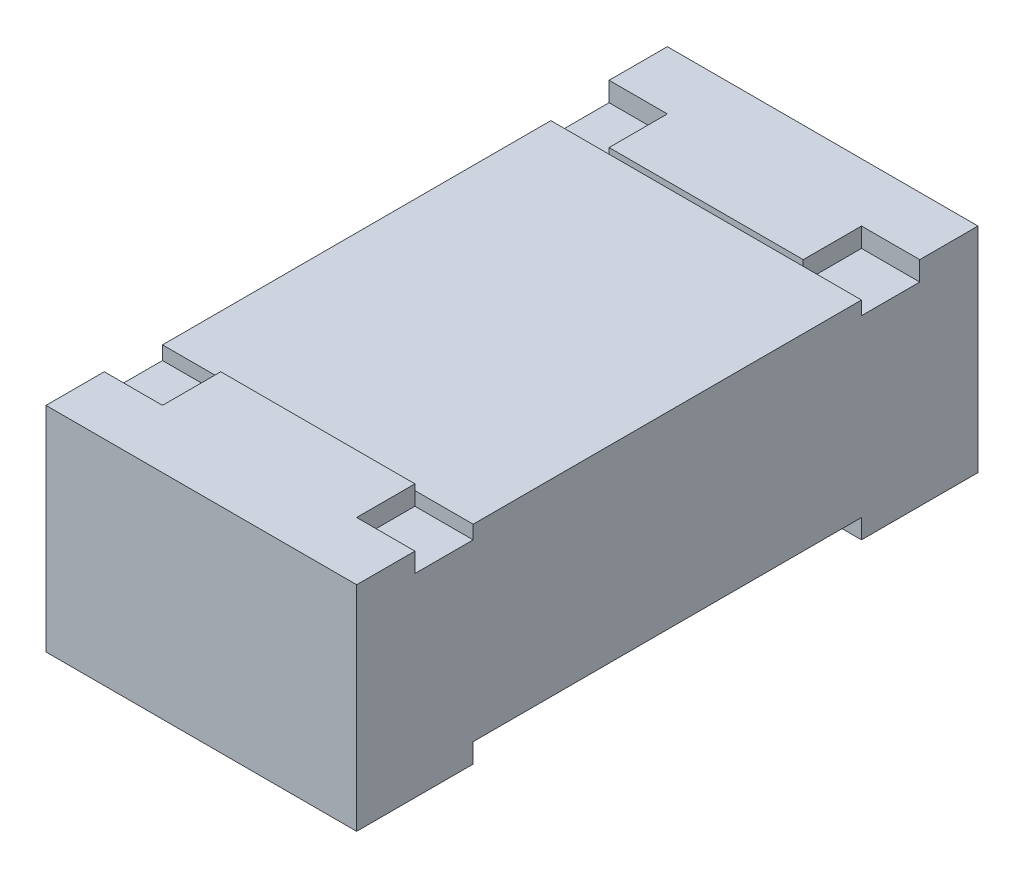
ISO-10303-21;
HEADER;
FILE_DESCRIPTION(('STEP AP214'),'2;1');
FILE_NAME('part.step','',(''),(''),'','','');
FILE_SCHEMA(('AUTOMOTIVE_DESIGN { 1 0 10303 214 1 1 1 1 }'));
ENDSEC;
DATA;
#1=APPLICATION_CONTEXT('core data for automotive mechanical design processes');
#2=APPLICATION_PROTOCOL_DEFINITION('international standard','automotive_design',2000,#1);
#3=PRODUCT_CONTEXT('',#1,'mechanical');
#4=PRODUCT('Part','Part','',(#3));
#5=PRODUCT_RELATED_PRODUCT_CATEGORY('part','',(#4));
#6=PRODUCT_DEFINITION_FORMATION('','',#4);
#7=PRODUCT_DEFINITION_CONTEXT('part definition',#1,'design');
#8=PRODUCT_DEFINITION('design','',#6,#7);
#9=PRODUCT_DEFINITION_SHAPE('','',#8);
#10=(LENGTH_UNIT() NAMED_UNIT(*) SI_UNIT(.MILLI.,.METRE.));
#11=(NAMED_UNIT(*) PLANE_ANGLE_UNIT() SI_UNIT($,.RADIAN.));
#12=(NAMED_UNIT(*) SI_UNIT($,.STERADIAN.) SOLID_ANGLE_UNIT());
#13=UNCERTAINTY_MEASURE_WITH_UNIT(LENGTH_MEASURE(1.E-05),#10,'distance_accuracy_value','');
#14=(GEOMETRIC_REPRESENTATION_CONTEXT(3) GLOBAL_UNCERTAINTY_ASSIGNED_CONTEXT((#13)) GLOBAL_UNIT_ASSIGNED_CONTEXT((#10,
#11,#12)) REPRESENTATION_CONTEXT('',''));
#15=CARTESIAN_POINT('',(0.,0.,0.));
#16=DIRECTION('',(0.,0.,1.));
#17=DIRECTION('',(1.,0.,0.));
#18=AXIS2_PLACEMENT_3D('',#15,#16,#17);
#19=CARTESIAN_POINT('',(-0.234998033030873,1.58166,-17.615));
#20=DIRECTION('',(0.,-1.,0.));
#21=DIRECTION('',(0.,0.,-1.));
#22=AXIS2_PLACEMENT_3D('',#19,#20,#21);
#23=PLANE('',#22);
#24=DIRECTION('',(-1.,0.,0.));
#25=VECTOR('',#24,1.);
#26=CARTESIAN_POINT('',(-0.234998033030869,1.58166,-17.915));
#27=LINE('',#26,#25);
#28=CARTESIAN_POINT('',(-0.234998033030869,1.58166,-17.915));
#29=VERTEX_POINT('',#28);
#30=CARTESIAN_POINT('',(-1.03499803303087,1.58166,-17.915));
#31=VERTEX_POINT('',#30);
#32=EDGE_CURVE('E19',#29,#31,#27,.T.);
#33=ORIENTED_EDGE('',*,*,#32,.F.);
#34=DIRECTION('',(0.,0.,-1.));
#35=VECTOR('',#34,1.);
#36=CARTESIAN_POINT('',(-0.234998033030869,1.58166,-17.915));
#37=LINE('',#36,#35);
#38=CARTESIAN_POINT('',(-0.234998033030871,1.58166,-17.615));
#39=VERTEX_POINT('',#38);
#40=EDGE_CURVE('E295',#39,#29,#37,.T.);
#41=ORIENTED_EDGE('',*,*,#40,.F.);
#42=DIRECTION('',(1.,0.,0.));
#43=VECTOR('',#42,1.);
#44=CARTESIAN_POINT('',(-0.234998033030873,1.58166,-17.615));
#45=LINE('',#44,#43);
#46=CARTESIAN_POINT('',(-1.03499803303087,1.58166,-17.615));
#47=VERTEX_POINT('',#46);
#48=EDGE_CURVE('E305',#47,#39,#45,.T.);
#49=ORIENTED_EDGE('',*,*,#48,.F.);
#50=DIRECTION('',(0.,0.,-1.));
#51=VECTOR('',#50,1.);
#52=CARTESIAN_POINT('',(-1.03499803303087,1.58166,-17.915));
#53=LINE('',#52,#51);
#54=EDGE_CURVE('E231',#47,#31,#53,.T.);
#55=ORIENTED_EDGE('',*,*,#54,.T.);
#56=EDGE_LOOP('',(#33,#41,#49,#55));
#57=FACE_BOUND('',#56,.T.);
#58=ADVANCED_FACE('F16',(#57),#23,.T.);
#59=CARTESIAN_POINT('',(-0.234998033030869,1.58166,-17.915));
#60=DIRECTION('',(0.,0.,-1.));
#61=DIRECTION('',(-1.,0.,0.));
#62=AXIS2_PLACEMENT_3D('',#59,#60,#61);
#63=PLANE('',#62);
#64=DIRECTION('',(1.,0.,0.));
#65=VECTOR('',#64,1.);
#66=CARTESIAN_POINT('',(-0.234998033030864,1.63166,-17.915));
#67=LINE('',#66,#65);
#68=CARTESIAN_POINT('',(-0.234998033030869,1.63166,-17.915));
#69=VERTEX_POINT('',#68);
#70=CARTESIAN_POINT('',(-1.03499803303087,1.63166,-17.915));
#71=VERTEX_POINT('',#70);
#72=EDGE_CURVE('E247',#69,#71,#67,.F.);
#73=ORIENTED_EDGE('',*,*,#72,.F.);
#74=DIRECTION('',(0.,1.,0.));
#75=VECTOR('',#74,1.);
#76=CARTESIAN_POINT('',(-0.234998033030869,1.58166,-17.915));
#77=LINE('',#76,#75);
#78=EDGE_CURVE('E226',#29,#69,#77,.T.);
#79=ORIENTED_EDGE('',*,*,#78,.F.);
#80=ORIENTED_EDGE('',*,*,#32,.T.);
#81=DIRECTION('',(0.,1.,0.));
#82=VECTOR('',#81,1.);
#83=CARTESIAN_POINT('',(-1.03499803303087,1.58166,-17.915));
#84=LINE('',#83,#82);
#85=EDGE_CURVE('E223',#31,#71,#84,.T.);
#86=ORIENTED_EDGE('',*,*,#85,.T.);
#87=EDGE_LOOP('',(#73,#79,#80,#86));
#88=FACE_BOUND('',#87,.T.);
#89=ADVANCED_FACE('F222',(#88),#63,.T.);
#90=CARTESIAN_POINT('',(-0.234998033030864,1.58166,-19.215));
#91=DIRECTION('',(0.,-1.,0.));
#92=DIRECTION('',(0.,0.,-1.));
#93=AXIS2_PLACEMENT_3D('',#90,#91,#92);
#94=PLANE('',#93);
#95=DIRECTION('',(-1.,0.,0.));
#96=VECTOR('',#95,1.);
#97=CARTESIAN_POINT('',(-0.234998033030864,1.58166,-19.215));
#98=LINE('',#97,#96);
#99=CARTESIAN_POINT('',(-0.234998033030865,1.58166,-19.215));
#100=VERTEX_POINT('',#99);
#101=CARTESIAN_POINT('',(-1.03499803303087,1.58166,-19.215));
#102=VERTEX_POINT('',#101);
#103=EDGE_CURVE('E192',#100,#102,#98,.T.);
#104=ORIENTED_EDGE('',*,*,#103,.F.);
#105=DIRECTION('',(0.,0.,1.));
#106=VECTOR('',#105,1.);
#107=CARTESIAN_POINT('',(-0.234998033030869,1.58166,-18.915));
#108=LINE('',#107,#106);
#109=CARTESIAN_POINT('',(-0.234998033030866,1.58166,-18.915));
#110=VERTEX_POINT('',#109);
#111=EDGE_CURVE('E291',#100,#110,#108,.T.);
#112=ORIENTED_EDGE('',*,*,#111,.T.);
#113=DIRECTION('',(1.,0.,0.));
#114=VECTOR('',#113,1.);
#115=CARTESIAN_POINT('',(-0.234998033030869,1.58166,-18.915));
#116=LINE('',#115,#114);
#117=CARTESIAN_POINT('',(-1.03499803303087,1.58166,-18.915));
#118=VERTEX_POINT('',#117);
#119=EDGE_CURVE('E187',#118,#110,#116,.T.);
#120=ORIENTED_EDGE('',*,*,#119,.F.);
#121=DIRECTION('',(0.,0.,1.));
#122=VECTOR('',#121,1.);
#123=CARTESIAN_POINT('',(-1.03499803303087,1.58166,-18.915));
#124=LINE('',#123,#122);
#125=EDGE_CURVE('E203',#102,#118,#124,.T.);
#126=ORIENTED_EDGE('',*,*,#125,.F.);
#127=EDGE_LOOP('',(#104,#112,#120,#126));
#128=FACE_BOUND('',#127,.T.);
#129=ADVANCED_FACE('F204',(#128),#94,.T.);
#130=CARTESIAN_POINT('',(-0.234998033030869,1.58166,-18.915));
#131=DIRECTION('',(0.,0.,1.));
#132=DIRECTION('',(1.,0.,0.));
#133=AXIS2_PLACEMENT_3D('',#130,#131,#132);
#134=PLANE('',#133);
#135=ORIENTED_EDGE('',*,*,#119,.T.);
#136=DIRECTION('',(0.,1.,0.));
#137=VECTOR('',#136,1.);
#138=CARTESIAN_POINT('',(-0.234998033030869,2.08166,-18.915));
#139=LINE('',#138,#137);
#140=CARTESIAN_POINT('',(-0.234998033030868,1.63166,-18.915));
#141=VERTEX_POINT('',#140);
#142=EDGE_CURVE('E289',#110,#141,#139,.T.);
#143=ORIENTED_EDGE('',*,*,#142,.T.);
#144=DIRECTION('',(1.,0.,0.));
#145=VECTOR('',#144,1.);
#146=CARTESIAN_POINT('',(-0.234998033030864,1.63166,-18.915));
#147=LINE('',#146,#145);
#148=CARTESIAN_POINT('',(-1.03499803303087,1.63166,-18.915));
#149=VERTEX_POINT('',#148);
#150=EDGE_CURVE('E245',#149,#141,#147,.T.);
#151=ORIENTED_EDGE('',*,*,#150,.F.);
#152=DIRECTION('',(0.,1.,0.));
#153=VECTOR('',#152,1.);
#154=CARTESIAN_POINT('',(-1.03499803303087,2.08166,-18.915));
#155=LINE('',#154,#153);
#156=EDGE_CURVE('E207',#118,#149,#155,.T.);
#157=ORIENTED_EDGE('',*,*,#156,.F.);
#158=EDGE_LOOP('',(#135,#143,#151,#157));
#159=FACE_BOUND('',#158,.T.);
#160=ADVANCED_FACE('F489',(#159),#134,.T.);
#161=CARTESIAN_POINT('',(-0.234998033030869,2.08166,-19.065));
#162=DIRECTION('',(0.,0.,-1.));
#163=DIRECTION('',(-1.,0.,0.));
#164=AXIS2_PLACEMENT_3D('',#161,#162,#163);
#165=PLANE('',#164);
#166=DIRECTION('',(0.,1.,0.));
#167=VECTOR('',#166,1.);
#168=CARTESIAN_POINT('',(-0.384998033030866,2.08166,-19.065));
#169=LINE('',#168,#167);
#170=CARTESIAN_POINT('',(-0.384998033030866,2.13166,-19.065));
#171=VERTEX_POINT('',#170);
#172=CARTESIAN_POINT('',(-0.384998033030866,2.08166,-19.065));
#173=VERTEX_POINT('',#172);
#174=EDGE_CURVE('E282',#171,#173,#169,.F.);
#175=ORIENTED_EDGE('',*,*,#174,.T.);
#176=DIRECTION('',(1.,0.,0.));
#177=VECTOR('',#176,1.);
#178=CARTESIAN_POINT('',(-0.234998033030864,2.08166,-19.065));
#179=LINE('',#178,#177);
#180=CARTESIAN_POINT('',(-0.234998033030868,2.08166,-19.065));
#181=VERTEX_POINT('',#180);
#182=EDGE_CURVE('E284',#181,#173,#179,.F.);
#183=ORIENTED_EDGE('',*,*,#182,.F.);
#184=DIRECTION('',(0.,1.,0.));
#185=VECTOR('',#184,1.);
#186=CARTESIAN_POINT('',(-0.234998033030868,2.08166,-19.065));
#187=LINE('',#186,#185);
#188=CARTESIAN_POINT('',(-0.234998033030869,2.13166,-19.065));
#189=VERTEX_POINT('',#188);
#190=EDGE_CURVE('E287',#181,#189,#187,.T.);
#191=ORIENTED_EDGE('',*,*,#190,.T.);
#192=DIRECTION('',(1.,0.,0.));
#193=VECTOR('',#192,1.);
#194=CARTESIAN_POINT('',(-0.234998033030869,2.13166,-19.065));
#195=LINE('',#194,#193);
#196=EDGE_CURVE('E274',#171,#189,#195,.T.);
#197=ORIENTED_EDGE('',*,*,#196,.F.);
#198=EDGE_LOOP('',(#175,#183,#191,#197));
#199=FACE_BOUND('',#198,.T.);
#200=ADVANCED_FACE('F491',(#199),#165,.F.);
#201=CARTESIAN_POINT('',(-0.234998033030864,2.13166,-19.215));
#202=DIRECTION('',(0.,0.,-1.));
#203=DIRECTION('',(-1.,0.,0.));
#204=AXIS2_PLACEMENT_3D('',#201,#202,#203);
#205=PLANE('',#204);
#206=DIRECTION('',(1.,0.,0.));
#207=VECTOR('',#206,1.);
#208=CARTESIAN_POINT('',(-0.234998033030869,2.13166,-19.215));
#209=LINE('',#208,#207);
#210=CARTESIAN_POINT('',(-0.234998033030867,2.13166,-19.215));
#211=VERTEX_POINT('',#210);
#212=CARTESIAN_POINT('',(-1.03499803303087,2.13166,-19.215));
#213=VERTEX_POINT('',#212);
#214=EDGE_CURVE('E269',#211,#213,#209,.F.);
#215=ORIENTED_EDGE('',*,*,#214,.F.);
#216=DIRECTION('',(0.,1.,0.));
#217=VECTOR('',#216,1.);
#218=CARTESIAN_POINT('',(-0.234998033030868,2.08166,-19.215));
#219=LINE('',#218,#217);
#220=EDGE_CURVE('E198',#211,#100,#219,.F.);
#221=ORIENTED_EDGE('',*,*,#220,.T.);
#222=ORIENTED_EDGE('',*,*,#103,.T.);
#223=DIRECTION('',(0.,1.,0.));
#224=VECTOR('',#223,1.);
#225=CARTESIAN_POINT('',(-1.03499803303087,2.08166,-19.215));
#226=LINE('',#225,#224);
#227=EDGE_CURVE('E196',#213,#102,#226,.F.);
#228=ORIENTED_EDGE('',*,*,#227,.F.);
#229=EDGE_LOOP('',(#215,#221,#222,#228));
#230=FACE_BOUND('',#229,.T.);
#231=ADVANCED_FACE('F194',(#230),#205,.T.);
#232=CARTESIAN_POINT('',(-1.03499803303087,2.08166,-19.065));
#233=DIRECTION('',(0.,0.,-1.));
#234=DIRECTION('',(-1.,0.,0.));
#235=AXIS2_PLACEMENT_3D('',#232,#233,#234);
#236=PLANE('',#235);
#237=DIRECTION('',(0.,1.,0.));
#238=VECTOR('',#237,1.);
#239=CARTESIAN_POINT('',(-1.03499803303087,2.08166,-19.065));
#240=LINE('',#239,#238);
#241=CARTESIAN_POINT('',(-1.03499803303087,2.08166,-19.065));
#242=VERTEX_POINT('',#241);
#243=CARTESIAN_POINT('',(-1.03499803303087,2.13166,-19.065));
#244=VERTEX_POINT('',#243);
#245=EDGE_CURVE('E200',#242,#244,#240,.T.);
#246=ORIENTED_EDGE('',*,*,#245,.F.);
#247=DIRECTION('',(1.,0.,0.));
#248=VECTOR('',#247,1.);
#249=CARTESIAN_POINT('',(-0.234998033030864,2.08166,-19.065));
#250=LINE('',#249,#248);
#251=CARTESIAN_POINT('',(-0.884998033030868,2.08166,-19.065));
#252=VERTEX_POINT('',#251);
#253=EDGE_CURVE('E249',#252,#242,#250,.F.);
#254=ORIENTED_EDGE('',*,*,#253,.F.);
#255=DIRECTION('',(0.,1.,0.));
#256=VECTOR('',#255,1.);
#257=CARTESIAN_POINT('',(-0.884998033030868,2.08166,-19.065));
#258=LINE('',#257,#256);
#259=CARTESIAN_POINT('',(-0.884998033030868,2.13166,-19.065));
#260=VERTEX_POINT('',#259);
#261=EDGE_CURVE('E263',#252,#260,#258,.T.);
#262=ORIENTED_EDGE('',*,*,#261,.T.);
#263=DIRECTION('',(1.,0.,0.));
#264=VECTOR('',#263,1.);
#265=CARTESIAN_POINT('',(-0.234998033030869,2.13166,-19.065));
#266=LINE('',#265,#264);
#267=EDGE_CURVE('E265',#244,#260,#266,.T.);
#268=ORIENTED_EDGE('',*,*,#267,.F.);
#269=EDGE_LOOP('',(#246,#254,#262,#268));
#270=FACE_BOUND('',#269,.T.);
#271=ADVANCED_FACE('F483',(#270),#236,.F.);
#272=CARTESIAN_POINT('',(-1.03499803303087,2.08166,-17.765));
#273=DIRECTION('',(0.,0.,1.));
#274=DIRECTION('',(1.,0.,0.));
#275=AXIS2_PLACEMENT_3D('',#272,#273,#274);
#276=PLANE('',#275);
#277=DIRECTION('',(0.,1.,0.));
#278=VECTOR('',#277,1.);
#279=CARTESIAN_POINT('',(-0.884998033030872,2.08166,-17.765));
#280=LINE('',#279,#278);
#281=CARTESIAN_POINT('',(-0.884998033030873,2.13166,-17.765));
#282=VERTEX_POINT('',#281);
#283=CARTESIAN_POINT('',(-0.884998033030873,2.08166,-17.765));
#284=VERTEX_POINT('',#283);
#285=EDGE_CURVE('E335',#282,#284,#280,.F.);
#286=ORIENTED_EDGE('',*,*,#285,.T.);
#287=DIRECTION('',(1.,0.,0.));
#288=VECTOR('',#287,1.);
#289=CARTESIAN_POINT('',(-0.234998033030864,2.08166,-17.765));
#290=LINE('',#289,#288);
#291=CARTESIAN_POINT('',(-1.03499803303087,2.08166,-17.765));
#292=VERTEX_POINT('',#291);
#293=EDGE_CURVE('E252',#292,#284,#290,.T.);
#294=ORIENTED_EDGE('',*,*,#293,.F.);
#295=DIRECTION('',(0.,1.,0.));
#296=VECTOR('',#295,1.);
#297=CARTESIAN_POINT('',(-1.03499803303087,1.58166,-17.765));
#298=LINE('',#297,#296);
#299=CARTESIAN_POINT('',(-1.03499803303087,2.13166,-17.765));
#300=VERTEX_POINT('',#299);
#301=EDGE_CURVE('E235',#292,#300,#298,.T.);
#302=ORIENTED_EDGE('',*,*,#301,.T.);
#303=DIRECTION('',(1.,0.,0.));
#304=VECTOR('',#303,1.);
#305=CARTESIAN_POINT('',(-0.234998033030869,2.13166,-17.765));
#306=LINE('',#305,#304);
#307=EDGE_CURVE('E318',#282,#300,#306,.F.);
#308=ORIENTED_EDGE('',*,*,#307,.F.);
#309=EDGE_LOOP('',(#286,#294,#302,#308));
#310=FACE_BOUND('',#309,.T.);
#311=ADVANCED_FACE('F553',(#310),#276,.F.);
#312=CARTESIAN_POINT('',(-0.234998033030873,2.13166,-17.615));
#313=DIRECTION('',(0.,0.,1.));
#314=DIRECTION('',(1.,0.,0.));
#315=AXIS2_PLACEMENT_3D('',#312,#313,#314);
#316=PLANE('',#315);
#317=ORIENTED_EDGE('',*,*,#48,.T.);
#318=DIRECTION('',(0.,1.,0.));
#319=VECTOR('',#318,1.);
#320=CARTESIAN_POINT('',(-0.23499803303087,1.58166,-17.615));
#321=LINE('',#320,#319);
#322=CARTESIAN_POINT('',(-0.234998033030872,2.13166,-17.615));
#323=VERTEX_POINT('',#322);
#324=EDGE_CURVE('E297',#323,#39,#321,.F.);
#325=ORIENTED_EDGE('',*,*,#324,.F.);
#326=DIRECTION('',(1.,0.,0.));
#327=VECTOR('',#326,1.);
#328=CARTESIAN_POINT('',(-0.234998033030869,2.13166,-17.615));
#329=LINE('',#328,#327);
#330=CARTESIAN_POINT('',(-1.03499803303087,2.13166,-17.615));
#331=VERTEX_POINT('',#330);
#332=EDGE_CURVE('E311',#331,#323,#329,.T.);
#333=ORIENTED_EDGE('',*,*,#332,.F.);
#334=DIRECTION('',(0.,1.,0.));
#335=VECTOR('',#334,1.);
#336=CARTESIAN_POINT('',(-1.03499803303087,2.13166,-17.615));
#337=LINE('',#336,#335);
#338=EDGE_CURVE('E237',#331,#47,#337,.F.);
#339=ORIENTED_EDGE('',*,*,#338,.T.);
#340=EDGE_LOOP('',(#317,#325,#333,#339));
#341=FACE_BOUND('',#340,.T.);
#342=ADVANCED_FACE('F309',(#341),#316,.T.);
#343=CARTESIAN_POINT('',(-0.234998033030873,2.08166,-17.765));
#344=DIRECTION('',(0.,0.,1.));
#345=DIRECTION('',(1.,0.,0.));
#346=AXIS2_PLACEMENT_3D('',#343,#344,#345);
#347=PLANE('',#346);
#348=DIRECTION('',(0.,1.,0.));
#349=VECTOR('',#348,1.);
#350=CARTESIAN_POINT('',(-0.234998033030869,1.58166,-17.765));
#351=LINE('',#350,#349);
#352=CARTESIAN_POINT('',(-0.234998033030872,2.08166,-17.765));
#353=VERTEX_POINT('',#352);
#354=CARTESIAN_POINT('',(-0.234998033030872,2.13166,-17.765));
#355=VERTEX_POINT('',#354);
#356=EDGE_CURVE('E300',#353,#355,#351,.T.);
#357=ORIENTED_EDGE('',*,*,#356,.F.);
#358=DIRECTION('',(1.,0.,0.));
#359=VECTOR('',#358,1.);
#360=CARTESIAN_POINT('',(-0.234998033030864,2.08166,-17.765));
#361=LINE('',#360,#359);
#362=CARTESIAN_POINT('',(-0.38499803303087,2.08166,-17.765));
#363=VERTEX_POINT('',#362);
#364=EDGE_CURVE('E400',#363,#353,#361,.T.);
#365=ORIENTED_EDGE('',*,*,#364,.F.);
#366=DIRECTION('',(0.,1.,0.));
#367=VECTOR('',#366,1.);
#368=CARTESIAN_POINT('',(-0.38499803303087,2.08166,-17.765));
#369=LINE('',#368,#367);
#370=CARTESIAN_POINT('',(-0.38499803303087,2.13166,-17.765));
#371=VERTEX_POINT('',#370);
#372=EDGE_CURVE('E405',#363,#371,#369,.T.);
#373=ORIENTED_EDGE('',*,*,#372,.T.);
#374=DIRECTION('',(1.,0.,0.));
#375=VECTOR('',#374,1.);
#376=CARTESIAN_POINT('',(-0.234998033030869,2.13166,-17.765));
#377=LINE('',#376,#375);
#378=EDGE_CURVE('E327',#355,#371,#377,.F.);
#379=ORIENTED_EDGE('',*,*,#378,.F.);
#380=EDGE_LOOP('',(#357,#365,#373,#379));
#381=FACE_BOUND('',#380,.T.);
#382=ADVANCED_FACE('F415',(#381),#347,.F.);
#383=CARTESIAN_POINT('',(-0.234998033030864,1.63166,-19.165));
#384=DIRECTION('',(0.,-1.,0.));
#385=DIRECTION('',(0.,0.,-1.));
#386=AXIS2_PLACEMENT_3D('',#383,#384,#385);
#387=PLANE('',#386);
#388=ORIENTED_EDGE('',*,*,#150,.T.);
#389=DIRECTION('',(0.,0.,1.));
#390=VECTOR('',#389,1.);
#391=CARTESIAN_POINT('',(-0.234998033030864,1.63166,-19.165));
#392=LINE('',#391,#390);
#393=EDGE_CURVE('E395',#141,#69,#392,.T.);
#394=ORIENTED_EDGE('',*,*,#393,.T.);
#395=ORIENTED_EDGE('',*,*,#72,.T.);
#396=DIRECTION('',(0.,0.,1.));
#397=VECTOR('',#396,1.);
#398=CARTESIAN_POINT('',(-1.03499803303087,1.63166,-19.165));
#399=LINE('',#398,#397);
#400=EDGE_CURVE('E234',#149,#71,#399,.T.);
#401=ORIENTED_EDGE('',*,*,#400,.F.);
#402=EDGE_LOOP('',(#388,#394,#395,#401));
#403=FACE_BOUND('',#402,.T.);
#404=ADVANCED_FACE('F243',(#403),#387,.T.);
#405=CARTESIAN_POINT('',(-0.234998033030864,2.08166,-19.165));
#406=DIRECTION('',(0.,1.,0.));
#407=DIRECTION('',(0.,0.,1.));
#408=AXIS2_PLACEMENT_3D('',#405,#406,#407);
#409=PLANE('',#408);
#410=DIRECTION('',(0.,0.,1.));
#411=VECTOR('',#410,1.);
#412=CARTESIAN_POINT('',(-0.234998033030864,2.08166,-19.165));
#413=LINE('',#412,#411);
#414=CARTESIAN_POINT('',(-0.234998033030868,2.08166,-18.915));
#415=VERTEX_POINT('',#414);
#416=EDGE_CURVE('E390',#415,#181,#413,.F.);
#417=ORIENTED_EDGE('',*,*,#416,.T.);
#418=ORIENTED_EDGE('',*,*,#182,.T.);
#419=DIRECTION('',(0.,0.,1.));
#420=VECTOR('',#419,1.);
#421=CARTESIAN_POINT('',(-0.384998033030866,2.08166,-19.065));
#422=LINE('',#421,#420);
#423=CARTESIAN_POINT('',(-0.384998033030866,2.08166,-18.915));
#424=VERTEX_POINT('',#423);
#425=EDGE_CURVE('E280',#173,#424,#422,.T.);
#426=ORIENTED_EDGE('',*,*,#425,.T.);
#427=DIRECTION('',(-1.,0.,0.));
#428=VECTOR('',#427,1.);
#429=CARTESIAN_POINT('',(-0.234998033030869,2.08166,-18.915));
#430=LINE('',#429,#428);
#431=EDGE_CURVE('E384',#415,#424,#430,.T.);
#432=ORIENTED_EDGE('',*,*,#431,.F.);
#433=EDGE_LOOP('',(#417,#418,#426,#432));
#434=FACE_BOUND('',#433,.T.);
#435=ADVANCED_FACE('F543',(#434),#409,.T.);
#436=CARTESIAN_POINT('',(-0.384998033030866,2.08166,-19.065));
#437=DIRECTION('',(-1.,0.,0.));
#438=DIRECTION('',(0.,0.,1.));
#439=AXIS2_PLACEMENT_3D('',#436,#437,#438);
#440=PLANE('',#439);
#441=DIRECTION('',(0.,1.,0.));
#442=VECTOR('',#441,1.);
#443=CARTESIAN_POINT('',(-0.384998033030866,2.11666,-18.915));
#444=LINE('',#443,#442);
#445=CARTESIAN_POINT('',(-0.384998033030866,2.11666,-18.915));
#446=VERTEX_POINT('',#445);
#447=EDGE_CURVE('E387',#424,#446,#444,.T.);
#448=ORIENTED_EDGE('',*,*,#447,.F.);
#449=ORIENTED_EDGE('',*,*,#425,.F.);
#450=ORIENTED_EDGE('',*,*,#174,.F.);
#451=DIRECTION('',(0.,0.,1.));
#452=VECTOR('',#451,1.);
#453=CARTESIAN_POINT('',(-0.384998033030866,2.13166,-18.915));
#454=LINE('',#453,#452);
#455=CARTESIAN_POINT('',(-0.384998033030866,2.13166,-18.915));
#456=VERTEX_POINT('',#455);
#457=EDGE_CURVE('E277',#456,#171,#454,.F.);
#458=ORIENTED_EDGE('',*,*,#457,.F.);
#459=DIRECTION('',(0.,1.,0.));
#460=VECTOR('',#459,1.);
#461=CARTESIAN_POINT('',(-0.384998033030866,2.13166,-18.915));
#462=LINE('',#461,#460);
#463=EDGE_CURVE('E381',#446,#456,#462,.T.);
#464=ORIENTED_EDGE('',*,*,#463,.F.);
#465=EDGE_LOOP('',(#448,#449,#450,#458,#464));
#466=FACE_BOUND('',#465,.T.);
#467=ADVANCED_FACE('F540',(#466),#440,.F.);
#468=CARTESIAN_POINT('',(-0.234998033030869,2.13166,-18.915));
#469=DIRECTION('',(0.,1.,0.));
#470=DIRECTION('',(0.,0.,1.));
#471=AXIS2_PLACEMENT_3D('',#468,#469,#470);
#472=PLANE('',#471);
#473=DIRECTION('',(0.,0.,-1.));
#474=VECTOR('',#473,1.);
#475=CARTESIAN_POINT('',(-0.884998033030868,2.13166,-19.065));
#476=LINE('',#475,#474);
#477=CARTESIAN_POINT('',(-0.884998033030868,2.13166,-18.915));
#478=VERTEX_POINT('',#477);
#479=EDGE_CURVE('E261',#260,#478,#476,.F.);
#480=ORIENTED_EDGE('',*,*,#479,.T.);
#481=DIRECTION('',(1.,0.,0.));
#482=VECTOR('',#481,1.);
#483=CARTESIAN_POINT('',(-0.234998033030869,2.13166,-18.915));
#484=LINE('',#483,#482);
#485=EDGE_CURVE('E378',#456,#478,#484,.F.);
#486=ORIENTED_EDGE('',*,*,#485,.F.);
#487=ORIENTED_EDGE('',*,*,#457,.T.);
#488=ORIENTED_EDGE('',*,*,#196,.T.);
#489=DIRECTION('',(0.,0.,1.));
#490=VECTOR('',#489,1.);
#491=CARTESIAN_POINT('',(-0.234998033030869,2.13166,-18.915));
#492=LINE('',#491,#490);
#493=EDGE_CURVE('E271',#189,#211,#492,.F.);
#494=ORIENTED_EDGE('',*,*,#493,.T.);
#495=ORIENTED_EDGE('',*,*,#214,.T.);
#496=DIRECTION('',(0.,0.,1.));
#497=VECTOR('',#496,1.);
#498=CARTESIAN_POINT('',(-1.03499803303087,2.13166,-18.915));
#499=LINE('',#498,#497);
#500=EDGE_CURVE('E211',#213,#244,#499,.T.);
#501=ORIENTED_EDGE('',*,*,#500,.T.);
#502=ORIENTED_EDGE('',*,*,#267,.T.);
#503=EDGE_LOOP('',(#480,#486,#487,#488,#494,#495,#501,#502));
#504=FACE_BOUND('',#503,.T.);
#505=ADVANCED_FACE('F486',(#504),#472,.T.);
#506=CARTESIAN_POINT('',(-0.884998033030868,2.08166,-19.065));
#507=DIRECTION('',(1.,0.,0.));
#508=DIRECTION('',(0.,0.,-1.));
#509=AXIS2_PLACEMENT_3D('',#506,#507,#508);
#510=PLANE('',#509);
#511=DIRECTION('',(0.,1.,0.));
#512=VECTOR('',#511,1.);
#513=CARTESIAN_POINT('',(-0.884998033030868,2.13166,-18.915));
#514=LINE('',#513,#512);
#515=CARTESIAN_POINT('',(-0.884998033030868,2.11666,-18.915));
#516=VERTEX_POINT('',#515);
#517=EDGE_CURVE('E375',#478,#516,#514,.F.);
#518=ORIENTED_EDGE('',*,*,#517,.F.);
#519=ORIENTED_EDGE('',*,*,#479,.F.);
#520=ORIENTED_EDGE('',*,*,#261,.F.);
#521=DIRECTION('',(0.,0.,1.));
#522=VECTOR('',#521,1.);
#523=CARTESIAN_POINT('',(-0.884998033030868,2.08166,-19.165));
#524=LINE('',#523,#522);
#525=CARTESIAN_POINT('',(-0.884998033030868,2.08166,-18.915));
#526=VERTEX_POINT('',#525);
#527=EDGE_CURVE('E255',#526,#252,#524,.F.);
#528=ORIENTED_EDGE('',*,*,#527,.F.);
#529=DIRECTION('',(0.,1.,0.));
#530=VECTOR('',#529,1.);
#531=CARTESIAN_POINT('',(-0.884998033030868,2.11666,-18.915));
#532=LINE('',#531,#530);
#533=EDGE_CURVE('E372',#516,#526,#532,.F.);
#534=ORIENTED_EDGE('',*,*,#533,.F.);
#535=EDGE_LOOP('',(#518,#519,#520,#528,#534));
#536=FACE_BOUND('',#535,.T.);
#537=ADVANCED_FACE('F534',(#536),#510,.F.);
#538=CARTESIAN_POINT('',(-0.234998033030864,2.08166,-19.165));
#539=DIRECTION('',(0.,1.,0.));
#540=DIRECTION('',(0.,0.,1.));
#541=AXIS2_PLACEMENT_3D('',#538,#539,#540);
#542=PLANE('',#541);
#543=DIRECTION('',(0.,0.,1.));
#544=VECTOR('',#543,1.);
#545=CARTESIAN_POINT('',(-1.03499803303087,2.08166,-19.165));
#546=LINE('',#545,#544);
#547=CARTESIAN_POINT('',(-1.03499803303087,2.08166,-18.915));
#548=VERTEX_POINT('',#547);
#549=EDGE_CURVE('E248',#548,#242,#546,.F.);
#550=ORIENTED_EDGE('',*,*,#549,.F.);
#551=DIRECTION('',(-1.,0.,0.));
#552=VECTOR('',#551,1.);
#553=CARTESIAN_POINT('',(-0.234998033030869,2.08166,-18.915));
#554=LINE('',#553,#552);
#555=EDGE_CURVE('E369',#526,#548,#554,.T.);
#556=ORIENTED_EDGE('',*,*,#555,.F.);
#557=ORIENTED_EDGE('',*,*,#527,.T.);
#558=ORIENTED_EDGE('',*,*,#253,.T.);
#559=EDGE_LOOP('',(#550,#556,#557,#558));
#560=FACE_BOUND('',#559,.T.);
#561=ADVANCED_FACE('F480',(#560),#542,.T.);
#562=CARTESIAN_POINT('',(-0.234998033030864,2.08166,-19.165));
#563=DIRECTION('',(0.,1.,0.));
#564=DIRECTION('',(0.,0.,1.));
#565=AXIS2_PLACEMENT_3D('',#562,#563,#564);
#566=PLANE('',#565);
#567=DIRECTION('',(1.,0.,0.));
#568=VECTOR('',#567,1.);
#569=CARTESIAN_POINT('',(-0.234998033030869,2.08166,-17.915));
#570=LINE('',#569,#568);
#571=CARTESIAN_POINT('',(-1.03499803303087,2.08166,-17.915));
#572=VERTEX_POINT('',#571);
#573=CARTESIAN_POINT('',(-0.884998033030872,2.08166,-17.915));
#574=VERTEX_POINT('',#573);
#575=EDGE_CURVE('E359',#572,#574,#570,.T.);
#576=ORIENTED_EDGE('',*,*,#575,.F.);
#577=DIRECTION('',(0.,0.,1.));
#578=VECTOR('',#577,1.);
#579=CARTESIAN_POINT('',(-1.03499803303087,2.08166,-19.165));
#580=LINE('',#579,#578);
#581=EDGE_CURVE('E337',#572,#292,#580,.T.);
#582=ORIENTED_EDGE('',*,*,#581,.T.);
#583=ORIENTED_EDGE('',*,*,#293,.T.);
#584=DIRECTION('',(0.,0.,-1.));
#585=VECTOR('',#584,1.);
#586=CARTESIAN_POINT('',(-0.884998033030868,2.08166,-19.065));
#587=LINE('',#586,#585);
#588=EDGE_CURVE('E333',#284,#574,#587,.T.);
#589=ORIENTED_EDGE('',*,*,#588,.T.);
#590=EDGE_LOOP('',(#576,#582,#583,#589));
#591=FACE_BOUND('',#590,.T.);
#592=ADVANCED_FACE('F343',(#591),#566,.T.);
#593=CARTESIAN_POINT('',(-0.884998033030868,2.08166,-19.065));
#594=DIRECTION('',(1.,0.,0.));
#595=DIRECTION('',(0.,0.,-1.));
#596=AXIS2_PLACEMENT_3D('',#593,#594,#595);
#597=PLANE('',#596);
#598=DIRECTION('',(0.,1.,0.));
#599=VECTOR('',#598,1.);
#600=CARTESIAN_POINT('',(-0.884998033030873,2.11666,-17.915));
#601=LINE('',#600,#599);
#602=CARTESIAN_POINT('',(-0.884998033030872,2.11666,-17.915));
#603=VERTEX_POINT('',#602);
#604=EDGE_CURVE('E348',#574,#603,#601,.T.);
#605=ORIENTED_EDGE('',*,*,#604,.F.);
#606=ORIENTED_EDGE('',*,*,#588,.F.);
#607=ORIENTED_EDGE('',*,*,#285,.F.);
#608=DIRECTION('',(0.,0.,1.));
#609=VECTOR('',#608,1.);
#610=CARTESIAN_POINT('',(-0.884998033030873,2.13166,-17.915));
#611=LINE('',#610,#609);
#612=CARTESIAN_POINT('',(-0.884998033030872,2.13166,-17.915));
#613=VERTEX_POINT('',#612);
#614=EDGE_CURVE('E324',#613,#282,#611,.T.);
#615=ORIENTED_EDGE('',*,*,#614,.F.);
#616=DIRECTION('',(0.,1.,0.));
#617=VECTOR('',#616,1.);
#618=CARTESIAN_POINT('',(-0.884998033030873,2.13166,-17.915));
#619=LINE('',#618,#617);
#620=EDGE_CURVE('E351',#603,#613,#619,.T.);
#621=ORIENTED_EDGE('',*,*,#620,.F.);
#622=EDGE_LOOP('',(#605,#606,#607,#615,#621));
#623=FACE_BOUND('',#622,.T.);
#624=ADVANCED_FACE('F346',(#623),#597,.F.);
#625=CARTESIAN_POINT('',(-0.234998033030869,2.13166,-17.915));
#626=DIRECTION('',(0.,1.,0.));
#627=DIRECTION('',(0.,0.,1.));
#628=AXIS2_PLACEMENT_3D('',#625,#626,#627);
#629=PLANE('',#628);
#630=ORIENTED_EDGE('',*,*,#332,.T.);
#631=DIRECTION('',(0.,0.,1.));
#632=VECTOR('',#631,1.);
#633=CARTESIAN_POINT('',(-0.234998033030873,2.13166,-17.915));
#634=LINE('',#633,#632);
#635=EDGE_CURVE('E407',#323,#355,#634,.F.);
#636=ORIENTED_EDGE('',*,*,#635,.T.);
#637=ORIENTED_EDGE('',*,*,#378,.T.);
#638=DIRECTION('',(0.,0.,1.));
#639=VECTOR('',#638,1.);
#640=CARTESIAN_POINT('',(-0.384998033030866,2.13166,-19.065));
#641=LINE('',#640,#639);
#642=CARTESIAN_POINT('',(-0.38499803303087,2.13166,-17.915));
#643=VERTEX_POINT('',#642);
#644=EDGE_CURVE('E403',#371,#643,#641,.F.);
#645=ORIENTED_EDGE('',*,*,#644,.T.);
#646=DIRECTION('',(-1.,0.,0.));
#647=VECTOR('',#646,1.);
#648=CARTESIAN_POINT('',(-0.234998033030869,2.13166,-17.915));
#649=LINE('',#648,#647);
#650=EDGE_CURVE('E362',#613,#643,#649,.F.);
#651=ORIENTED_EDGE('',*,*,#650,.F.);
#652=ORIENTED_EDGE('',*,*,#614,.T.);
#653=ORIENTED_EDGE('',*,*,#307,.T.);
#654=DIRECTION('',(0.,0.,1.));
#655=VECTOR('',#654,1.);
#656=CARTESIAN_POINT('',(-1.03499803303087,2.13166,-17.915));
#657=LINE('',#656,#655);
#658=EDGE_CURVE('E314',#300,#331,#657,.T.);
#659=ORIENTED_EDGE('',*,*,#658,.T.);
#660=EDGE_LOOP('',(#630,#636,#637,#645,#651,#652,#653,#659));
#661=FACE_BOUND('',#660,.T.);
#662=ADVANCED_FACE('F322',(#661),#629,.T.);
#663=CARTESIAN_POINT('',(-0.384998033030866,2.08166,-19.065));
#664=DIRECTION('',(-1.,0.,0.));
#665=DIRECTION('',(0.,0.,1.));
#666=AXIS2_PLACEMENT_3D('',#663,#664,#665);
#667=PLANE('',#666);
#668=DIRECTION('',(0.,1.,0.));
#669=VECTOR('',#668,1.);
#670=CARTESIAN_POINT('',(-0.38499803303087,2.13166,-17.915));
#671=LINE('',#670,#669);
#672=CARTESIAN_POINT('',(-0.38499803303087,2.11666,-17.915));
#673=VERTEX_POINT('',#672);
#674=EDGE_CURVE('E427',#643,#673,#671,.F.);
#675=ORIENTED_EDGE('',*,*,#674,.F.);
#676=ORIENTED_EDGE('',*,*,#644,.F.);
#677=ORIENTED_EDGE('',*,*,#372,.F.);
#678=DIRECTION('',(0.,0.,1.));
#679=VECTOR('',#678,1.);
#680=CARTESIAN_POINT('',(-0.38499803303087,2.08166,-19.165));
#681=LINE('',#680,#679);
#682=CARTESIAN_POINT('',(-0.38499803303087,2.08166,-17.915));
#683=VERTEX_POINT('',#682);
#684=EDGE_CURVE('E397',#683,#363,#681,.T.);
#685=ORIENTED_EDGE('',*,*,#684,.F.);
#686=DIRECTION('',(0.,1.,0.));
#687=VECTOR('',#686,1.);
#688=CARTESIAN_POINT('',(-0.38499803303087,2.11666,-17.915));
#689=LINE('',#688,#687);
#690=EDGE_CURVE('E425',#673,#683,#689,.F.);
#691=ORIENTED_EDGE('',*,*,#690,.F.);
#692=EDGE_LOOP('',(#675,#676,#677,#685,#691));
#693=FACE_BOUND('',#692,.T.);
#694=ADVANCED_FACE('F424',(#693),#667,.F.);
#695=CARTESIAN_POINT('',(-0.234998033030864,2.08166,-19.165));
#696=DIRECTION('',(0.,1.,0.));
#697=DIRECTION('',(0.,0.,1.));
#698=AXIS2_PLACEMENT_3D('',#695,#696,#697);
#699=PLANE('',#698);
#700=DIRECTION('',(1.,0.,0.));
#701=VECTOR('',#700,1.);
#702=CARTESIAN_POINT('',(-0.234998033030869,2.08166,-17.915));
#703=LINE('',#702,#701);
#704=CARTESIAN_POINT('',(-0.234998033030871,2.08166,-17.915));
#705=VERTEX_POINT('',#704);
#706=EDGE_CURVE('E420',#683,#705,#703,.T.);
#707=ORIENTED_EDGE('',*,*,#706,.F.);
#708=ORIENTED_EDGE('',*,*,#684,.T.);
#709=ORIENTED_EDGE('',*,*,#364,.T.);
#710=DIRECTION('',(0.,0.,1.));
#711=VECTOR('',#710,1.);
#712=CARTESIAN_POINT('',(-0.234998033030864,2.08166,-19.165));
#713=LINE('',#712,#711);
#714=EDGE_CURVE('E393',#353,#705,#713,.F.);
#715=ORIENTED_EDGE('',*,*,#714,.T.);
#716=EDGE_LOOP('',(#707,#708,#709,#715));
#717=FACE_BOUND('',#716,.T.);
#718=ADVANCED_FACE('F419',(#717),#699,.T.);
#719=CARTESIAN_POINT('',(-0.234998033030869,2.11666,-18.915));
#720=DIRECTION('',(0.,0.,-1.));
#721=DIRECTION('',(-1.,0.,0.));
#722=AXIS2_PLACEMENT_3D('',#719,#720,#721);
#723=PLANE('',#722);
#724=DIRECTION('',(0.,1.,0.));
#725=VECTOR('',#724,1.);
#726=CARTESIAN_POINT('',(-0.234998033030869,2.08166,-18.915));
#727=LINE('',#726,#725);
#728=CARTESIAN_POINT('',(-0.234998033030869,2.11666,-18.915));
#729=VERTEX_POINT('',#728);
#730=EDGE_CURVE('E455',#729,#415,#727,.F.);
#731=ORIENTED_EDGE('',*,*,#730,.T.);
#732=ORIENTED_EDGE('',*,*,#431,.T.);
#733=ORIENTED_EDGE('',*,*,#447,.T.);
#734=DIRECTION('',(1.,0.,0.));
#735=VECTOR('',#734,1.);
#736=CARTESIAN_POINT('',(-0.234998033030869,2.11666,-18.915));
#737=LINE('',#736,#735);
#738=EDGE_CURVE('E452',#729,#446,#737,.F.);
#739=ORIENTED_EDGE('',*,*,#738,.F.);
#740=EDGE_LOOP('',(#731,#732,#733,#739));
#741=FACE_BOUND('',#740,.T.);
#742=ADVANCED_FACE('F466',(#741),#723,.T.);
#743=CARTESIAN_POINT('',(-0.234998033030869,2.13166,-18.915));
#744=DIRECTION('',(0.,0.,1.));
#745=DIRECTION('',(1.,0.,0.));
#746=AXIS2_PLACEMENT_3D('',#743,#744,#745);
#747=PLANE('',#746);
#748=ORIENTED_EDGE('',*,*,#485,.T.);
#749=ORIENTED_EDGE('',*,*,#517,.T.);
#750=DIRECTION('',(1.,0.,0.));
#751=VECTOR('',#750,1.);
#752=CARTESIAN_POINT('',(-0.234998033030869,2.11666,-18.915));
#753=LINE('',#752,#751);
#754=EDGE_CURVE('E449',#446,#516,#753,.F.);
#755=ORIENTED_EDGE('',*,*,#754,.F.);
#756=ORIENTED_EDGE('',*,*,#463,.T.);
#757=EDGE_LOOP('',(#748,#749,#755,#756));
#758=FACE_BOUND('',#757,.T.);
#759=ADVANCED_FACE('F472',(#758),#747,.T.);
#760=CARTESIAN_POINT('',(-0.234998033030869,2.11666,-18.915));
#761=DIRECTION('',(0.,0.,-1.));
#762=DIRECTION('',(-1.,0.,0.));
#763=AXIS2_PLACEMENT_3D('',#760,#761,#762);
#764=PLANE('',#763);
#765=DIRECTION('',(0.,1.,0.));
#766=VECTOR('',#765,1.);
#767=CARTESIAN_POINT('',(-1.03499803303087,2.08166,-18.915));
#768=LINE('',#767,#766);
#769=CARTESIAN_POINT('',(-1.03499803303087,2.11666,-18.915));
#770=VERTEX_POINT('',#769);
#771=EDGE_CURVE('E356',#770,#548,#768,.F.);
#772=ORIENTED_EDGE('',*,*,#771,.F.);
#773=DIRECTION('',(1.,0.,0.));
#774=VECTOR('',#773,1.);
#775=CARTESIAN_POINT('',(-0.234998033030869,2.11666,-18.915));
#776=LINE('',#775,#774);
#777=EDGE_CURVE('E444',#516,#770,#776,.F.);
#778=ORIENTED_EDGE('',*,*,#777,.F.);
#779=ORIENTED_EDGE('',*,*,#533,.T.);
#780=ORIENTED_EDGE('',*,*,#555,.T.);
#781=EDGE_LOOP('',(#772,#778,#779,#780));
#782=FACE_BOUND('',#781,.T.);
#783=ADVANCED_FACE('F476',(#782),#764,.T.);
#784=CARTESIAN_POINT('',(-1.03499803303087,2.08166,-18.915));
#785=DIRECTION('',(-1.,0.,0.));
#786=DIRECTION('',(0.,0.,1.));
#787=AXIS2_PLACEMENT_3D('',#784,#785,#786);
#788=PLANE('',#787);
#789=ORIENTED_EDGE('',*,*,#156,.T.);
#790=ORIENTED_EDGE('',*,*,#400,.T.);
#791=ORIENTED_EDGE('',*,*,#85,.F.);
#792=ORIENTED_EDGE('',*,*,#54,.F.);
#793=ORIENTED_EDGE('',*,*,#338,.F.);
#794=ORIENTED_EDGE('',*,*,#658,.F.);
#795=ORIENTED_EDGE('',*,*,#301,.F.);
#796=ORIENTED_EDGE('',*,*,#581,.F.);
#797=DIRECTION('',(0.,1.,0.));
#798=VECTOR('',#797,1.);
#799=CARTESIAN_POINT('',(-1.03499803303087,2.11666,-17.915));
#800=LINE('',#799,#798);
#801=CARTESIAN_POINT('',(-1.03499803303087,2.11666,-17.915));
#802=VERTEX_POINT('',#801);
#803=EDGE_CURVE('E355',#802,#572,#800,.F.);
#804=ORIENTED_EDGE('',*,*,#803,.F.);
#805=DIRECTION('',(0.,0.,1.));
#806=VECTOR('',#805,1.);
#807=CARTESIAN_POINT('',(-1.03499803303087,2.11666,-18.915));
#808=LINE('',#807,#806);
#809=EDGE_CURVE('E442',#770,#802,#808,.T.);
#810=ORIENTED_EDGE('',*,*,#809,.F.);
#811=ORIENTED_EDGE('',*,*,#771,.T.);
#812=ORIENTED_EDGE('',*,*,#549,.T.);
#813=ORIENTED_EDGE('',*,*,#245,.T.);
#814=ORIENTED_EDGE('',*,*,#500,.F.);
#815=ORIENTED_EDGE('',*,*,#227,.T.);
#816=ORIENTED_EDGE('',*,*,#125,.T.);
#817=EDGE_LOOP('',(#789,#790,#791,#792,#793,#794,#795,#796,#804,#810,#811,#812,#813,#814,#815,#816));
#818=FACE_BOUND('',#817,.T.);
#819=ADVANCED_FACE('F209',(#818),#788,.T.);
#820=CARTESIAN_POINT('',(-0.234998033030869,2.11666,-17.915));
#821=DIRECTION('',(0.,0.,1.));
#822=DIRECTION('',(1.,0.,0.));
#823=AXIS2_PLACEMENT_3D('',#820,#821,#822);
#824=PLANE('',#823);
#825=ORIENTED_EDGE('',*,*,#803,.T.);
#826=ORIENTED_EDGE('',*,*,#575,.T.);
#827=ORIENTED_EDGE('',*,*,#604,.T.);
#828=DIRECTION('',(1.,0.,0.));
#829=VECTOR('',#828,1.);
#830=CARTESIAN_POINT('',(-0.234998033030869,2.11666,-17.915));
#831=LINE('',#830,#829);
#832=EDGE_CURVE('E436',#802,#603,#831,.T.);
#833=ORIENTED_EDGE('',*,*,#832,.F.);
#834=EDGE_LOOP('',(#825,#826,#827,#833));
#835=FACE_BOUND('',#834,.T.);
#836=ADVANCED_FACE('F360',(#835),#824,.T.);
#837=CARTESIAN_POINT('',(-0.234998033030869,2.13166,-17.915));
#838=DIRECTION('',(0.,0.,-1.));
#839=DIRECTION('',(-1.,0.,0.));
#840=AXIS2_PLACEMENT_3D('',#837,#838,#839);
#841=PLANE('',#840);
#842=ORIENTED_EDGE('',*,*,#650,.T.);
#843=ORIENTED_EDGE('',*,*,#674,.T.);
#844=DIRECTION('',(1.,0.,0.));
#845=VECTOR('',#844,1.);
#846=CARTESIAN_POINT('',(-0.234998033030869,2.11666,-17.915));
#847=LINE('',#846,#845);
#848=EDGE_CURVE('E432',#603,#673,#847,.T.);
#849=ORIENTED_EDGE('',*,*,#848,.F.);
#850=ORIENTED_EDGE('',*,*,#620,.T.);
#851=EDGE_LOOP('',(#842,#843,#849,#850));
#852=FACE_BOUND('',#851,.T.);
#853=ADVANCED_FACE('F430',(#852),#841,.T.);
#854=CARTESIAN_POINT('',(-0.234998033030869,2.11666,-17.915));
#855=DIRECTION('',(0.,0.,1.));
#856=DIRECTION('',(1.,0.,0.));
#857=AXIS2_PLACEMENT_3D('',#854,#855,#856);
#858=PLANE('',#857);
#859=DIRECTION('',(0.,1.,0.));
#860=VECTOR('',#859,1.);
#861=CARTESIAN_POINT('',(-0.234998033030872,2.08166,-17.915));
#862=LINE('',#861,#860);
#863=CARTESIAN_POINT('',(-0.23499803303087,2.11666,-17.915));
#864=VERTEX_POINT('',#863);
#865=EDGE_CURVE('E34',#705,#864,#862,.T.);
#866=ORIENTED_EDGE('',*,*,#865,.T.);
#867=DIRECTION('',(1.,0.,0.));
#868=VECTOR('',#867,1.);
#869=CARTESIAN_POINT('',(-0.234998033030869,2.11666,-17.915));
#870=LINE('',#869,#868);
#871=EDGE_CURVE('E25',#673,#864,#870,.T.);
#872=ORIENTED_EDGE('',*,*,#871,.F.);
#873=ORIENTED_EDGE('',*,*,#690,.T.);
#874=ORIENTED_EDGE('',*,*,#706,.T.);
#875=EDGE_LOOP('',(#866,#872,#873,#874));
#876=FACE_BOUND('',#875,.T.);
#877=ADVANCED_FACE('F461',(#876),#858,.T.);
#878=CARTESIAN_POINT('',(-0.234998033030869,2.08166,-18.915));
#879=DIRECTION('',(-1.,0.,0.));
#880=DIRECTION('',(0.,0.,1.));
#881=AXIS2_PLACEMENT_3D('',#878,#879,#880);
#882=PLANE('',#881);
#883=ORIENTED_EDGE('',*,*,#393,.F.);
#884=ORIENTED_EDGE('',*,*,#142,.F.);
#885=ORIENTED_EDGE('',*,*,#111,.F.);
#886=ORIENTED_EDGE('',*,*,#220,.F.);
#887=ORIENTED_EDGE('',*,*,#493,.F.);
#888=ORIENTED_EDGE('',*,*,#190,.F.);
#889=ORIENTED_EDGE('',*,*,#416,.F.);
#890=ORIENTED_EDGE('',*,*,#730,.F.);
#891=DIRECTION('',(0.,0.,1.));
#892=VECTOR('',#891,1.);
#893=CARTESIAN_POINT('',(-0.234998033030869,2.11666,-18.915));
#894=LINE('',#893,#892);
#895=EDGE_CURVE('E11',#864,#729,#894,.F.);
#896=ORIENTED_EDGE('',*,*,#895,.F.);
#897=ORIENTED_EDGE('',*,*,#865,.F.);
#898=ORIENTED_EDGE('',*,*,#714,.F.);
#899=ORIENTED_EDGE('',*,*,#356,.T.);
#900=ORIENTED_EDGE('',*,*,#635,.F.);
#901=ORIENTED_EDGE('',*,*,#324,.T.);
#902=ORIENTED_EDGE('',*,*,#40,.T.);
#903=ORIENTED_EDGE('',*,*,#78,.T.);
#904=EDGE_LOOP('',(#883,#884,#885,#886,#887,#888,#889,#890,#896,#897,#898,#899,#900,#901,#902,#903));
#905=FACE_BOUND('',#904,.T.);
#906=ADVANCED_FACE('F412',(#905),#882,.F.);
#907=CARTESIAN_POINT('',(-0.234998033030869,2.11666,-18.915));
#908=DIRECTION('',(0.,1.,0.));
#909=DIRECTION('',(0.,0.,1.));
#910=AXIS2_PLACEMENT_3D('',#907,#908,#909);
#911=PLANE('',#910);
#912=ORIENTED_EDGE('',*,*,#871,.T.);
#913=ORIENTED_EDGE('',*,*,#895,.T.);
#914=ORIENTED_EDGE('',*,*,#738,.T.);
#915=ORIENTED_EDGE('',*,*,#754,.T.);
#916=ORIENTED_EDGE('',*,*,#777,.T.);
#917=ORIENTED_EDGE('',*,*,#809,.T.);
#918=ORIENTED_EDGE('',*,*,#832,.T.);
#919=ORIENTED_EDGE('',*,*,#848,.T.);
#920=EDGE_LOOP('',(#912,#913,#914,#915,#916,#917,#918,#919));
#921=FACE_BOUND('',#920,.T.);
#922=ADVANCED_FACE('F439',(#921),#911,.T.);
#923=CLOSED_SHELL('',(#58,#89,#129,#160,#200,#231,#271,#311,#342,#382,#404,#435,#467,#505,#537,
#561,#592,#624,#662,#694,#718,#742,#759,#783,#819,#836,#853,#877,#906,#922));
#924=MANIFOLD_SOLID_BREP('B1',#923);
#925=ADVANCED_BREP_SHAPE_REPRESENTATION('',(#18,#924),#14);
#926=SHAPE_DEFINITION_REPRESENTATION(#9,#925);
ENDSEC;
END-ISO-10303-21;
